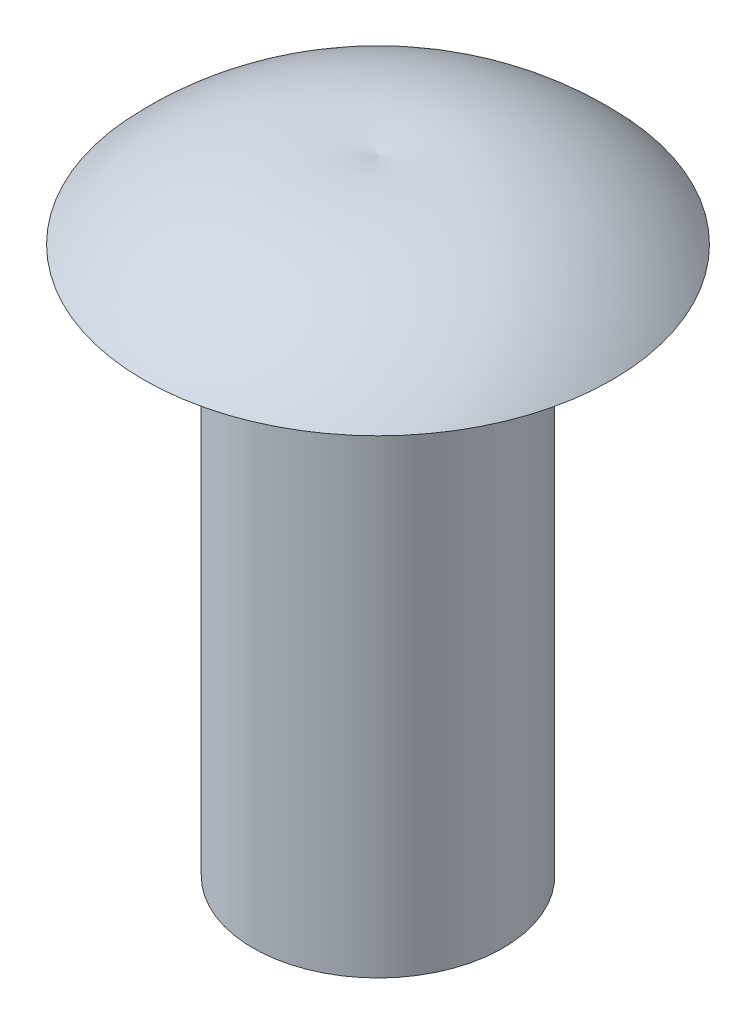
ISO-10303-21;
HEADER;
FILE_DESCRIPTION(('STEP AP214'),'2;1');
FILE_NAME('part.step','',(''),(''),'','','');
FILE_SCHEMA(('AUTOMOTIVE_DESIGN { 1 0 10303 214 1 1 1 1 }'));
ENDSEC;
DATA;
#1=APPLICATION_CONTEXT('core data for automotive mechanical design processes');
#2=APPLICATION_PROTOCOL_DEFINITION('international standard','automotive_design',2000,#1);
#3=PRODUCT_CONTEXT('',#1,'mechanical');
#4=PRODUCT('Part','Part','',(#3));
#5=PRODUCT_RELATED_PRODUCT_CATEGORY('part','',(#4));
#6=PRODUCT_DEFINITION_FORMATION('','',#4);
#7=PRODUCT_DEFINITION_CONTEXT('part definition',#1,'design');
#8=PRODUCT_DEFINITION('design','',#6,#7);
#9=PRODUCT_DEFINITION_SHAPE('','',#8);
#10=(LENGTH_UNIT() NAMED_UNIT(*) SI_UNIT(.MILLI.,.METRE.));
#11=(NAMED_UNIT(*) PLANE_ANGLE_UNIT() SI_UNIT($,.RADIAN.));
#12=(NAMED_UNIT(*) SI_UNIT($,.STERADIAN.) SOLID_ANGLE_UNIT());
#13=UNCERTAINTY_MEASURE_WITH_UNIT(LENGTH_MEASURE(1.E-05),#10,'distance_accuracy_value','');
#14=(GEOMETRIC_REPRESENTATION_CONTEXT(3) GLOBAL_UNCERTAINTY_ASSIGNED_CONTEXT((#13)) GLOBAL_UNIT_ASSIGNED_CONTEXT((#10,
#11,#12)) REPRESENTATION_CONTEXT('',''));
#15=CARTESIAN_POINT('',(0.,0.,0.));
#16=DIRECTION('',(0.,0.,1.));
#17=DIRECTION('',(1.,0.,0.));
#18=AXIS2_PLACEMENT_3D('',#15,#16,#17);
#19=CARTESIAN_POINT('',(0.,6.0564903158108,-0.876082567048295));
#20=DIRECTION('',(-1.,0.,0.));
#21=DIRECTION('',(0.,0.,-1.));
#22=AXIS2_PLACEMENT_3D('',#19,#20,#21);
#23=CIRCLE('',#22,5.13060390883639);
#24=TRIMMED_CURVE('',#23,(PARAMETER_VALUE(-1.74239344425326)),
(PARAMETER_VALUE(1.74239344425326)),.T.,.PARAMETER.);
#25=CARTESIAN_POINT('',(0.,6.0564903158108,0.));
#26=DIRECTION('',(0.,-1.,0.));
#27=AXIS1_PLACEMENT('',#25,#26);
#28=SURFACE_OF_REVOLUTION('',#24,#27);
#29=CARTESIAN_POINT('',(0.,11.1117426146661,0.));
#30=VERTEX_POINT('',#29);
#31=VERTEX_LOOP('',#30);
#32=FACE_BOUND('',#31,.T.);
#33=CARTESIAN_POINT('',(0.,9.57504261466612,0.));
#34=DIRECTION('',(0.,-1.,0.));
#35=DIRECTION('',(0.,0.,-1.));
#36=AXIS2_PLACEMENT_3D('',#33,#34,#35);
#37=CIRCLE('',#36,4.6101);
#38=CARTESIAN_POINT('',(0.,9.57504261466612,-4.6101));
#39=VERTEX_POINT('',#38);
#40=EDGE_CURVE('E11',#39,#39,#37,.T.);
#41=ORIENTED_EDGE('',*,*,#40,.F.);
#42=EDGE_LOOP('',(#41));
#43=FACE_BOUND('',#42,.T.);
#44=ADVANCED_FACE('F36',(#32,#43),#28,.T.);
#45=CARTESIAN_POINT('',(2.45872,9.57504261466612,0.));
#46=DIRECTION('',(0.,-1.,0.));
#47=DIRECTION('',(0.,0.,-1.));
#48=AXIS2_PLACEMENT_3D('',#45,#46,#47);
#49=PLANE('',#48);
#50=ORIENTED_EDGE('',*,*,#40,.T.);
#51=EDGE_LOOP('',(#50));
#52=FACE_BOUND('',#51,.T.);
#53=CARTESIAN_POINT('',(0.,9.57504261466612,0.));
#54=DIRECTION('',(0.,-1.,0.));
#55=DIRECTION('',(0.,0.,-1.));
#56=AXIS2_PLACEMENT_3D('',#53,#54,#55);
#57=CIRCLE('',#56,2.45872);
#58=CARTESIAN_POINT('',(0.,9.57504261466612,-2.45872));
#59=VERTEX_POINT('',#58);
#60=EDGE_CURVE('E42',#59,#59,#57,.T.);
#61=ORIENTED_EDGE('',*,*,#60,.F.);
#62=EDGE_LOOP('',(#61));
#63=FACE_BOUND('',#62,.T.);
#64=ADVANCED_FACE('F47',(#52,#63),#49,.T.);
#65=CARTESIAN_POINT('',(0.,-1.18185738533388,0.));
#66=DIRECTION('',(0.,-1.,0.));
#67=DIRECTION('',(0.,0.,-1.));
#68=AXIS2_PLACEMENT_3D('',#65,#66,#67);
#69=CYLINDRICAL_SURFACE('',#68,2.45872);
#70=ORIENTED_EDGE('',*,*,#60,.T.);
#71=EDGE_LOOP('',(#70));
#72=FACE_BOUND('',#71,.T.);
#73=CARTESIAN_POINT('',(0.,-1.18185738533388,0.));
#74=DIRECTION('',(0.,-1.,0.));
#75=DIRECTION('',(0.,0.,-1.));
#76=AXIS2_PLACEMENT_3D('',#73,#74,#75);
#77=CIRCLE('',#76,2.45872);
#78=CARTESIAN_POINT('',(0.,-1.18185738533388,-2.45872));
#79=VERTEX_POINT('',#78);
#80=EDGE_CURVE('E56',#79,#79,#77,.T.);
#81=ORIENTED_EDGE('',*,*,#80,.F.);
#82=EDGE_LOOP('',(#81));
#83=FACE_BOUND('',#82,.T.);
#84=ADVANCED_FACE('F52',(#72,#83),#69,.T.);
#85=CARTESIAN_POINT('',(0.,-1.18185738533388,0.));
#86=DIRECTION('',(0.,-1.,0.));
#87=DIRECTION('',(0.,0.,-1.));
#88=AXIS2_PLACEMENT_3D('',#85,#86,#87);
#89=PLANE('',#88);
#90=ORIENTED_EDGE('',*,*,#80,.T.);
#91=EDGE_LOOP('',(#90));
#92=FACE_BOUND('',#91,.T.);
#93=ADVANCED_FACE('F61',(#92),#89,.T.);
#94=CLOSED_SHELL('',(#44,#64,#84,#93));
#95=MANIFOLD_SOLID_BREP('B2',#94);
#96=ADVANCED_BREP_SHAPE_REPRESENTATION('',(#18,#95),#14);
#97=SHAPE_DEFINITION_REPRESENTATION(#9,#96);
ENDSEC;
END-ISO-10303-21;
